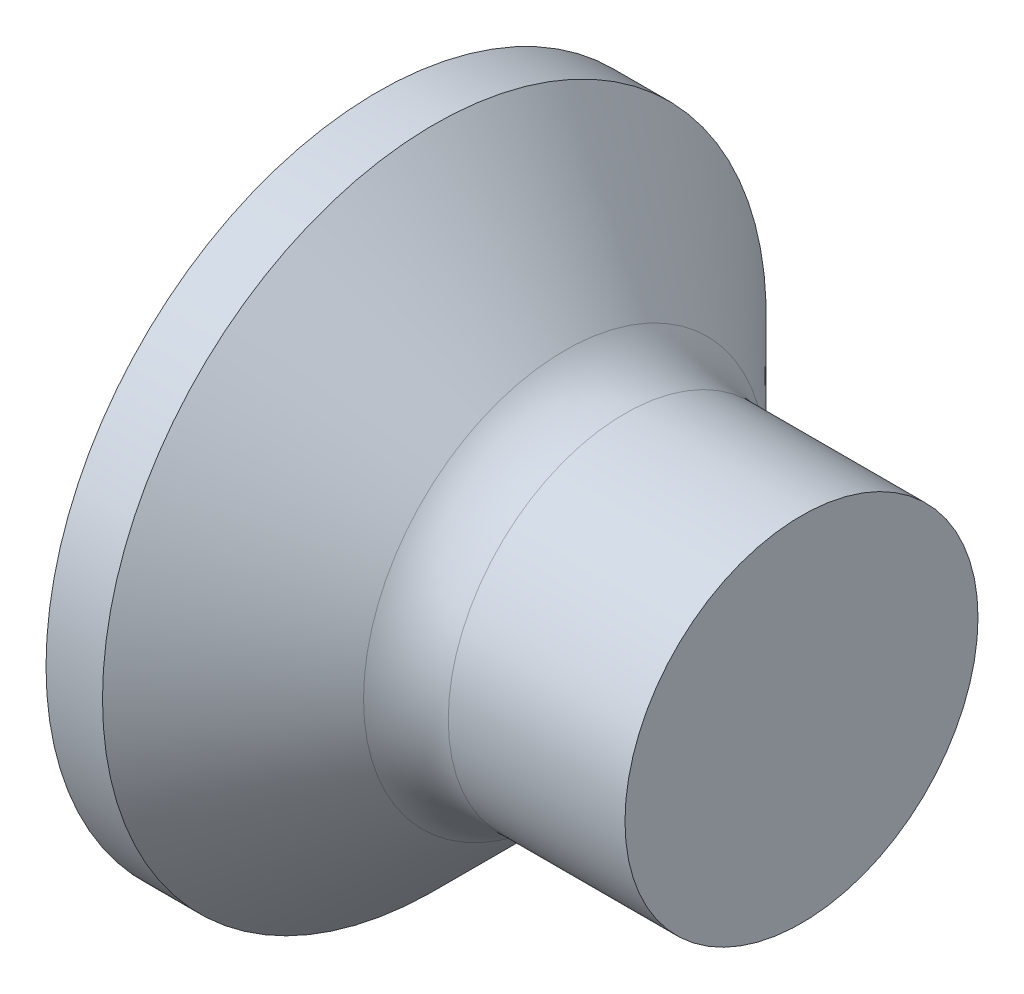
ISO-10303-21;
HEADER;
FILE_DESCRIPTION(('STEP AP214'),'2;1');
FILE_NAME('part.step','',(''),(''),'','','');
FILE_SCHEMA(('AUTOMOTIVE_DESIGN { 1 0 10303 214 1 1 1 1 }'));
ENDSEC;
DATA;
#1=APPLICATION_CONTEXT('core data for automotive mechanical design processes');
#2=APPLICATION_PROTOCOL_DEFINITION('international standard','automotive_design',2000,#1);
#3=PRODUCT_CONTEXT('',#1,'mechanical');
#4=PRODUCT('Part','Part','',(#3));
#5=PRODUCT_RELATED_PRODUCT_CATEGORY('part','',(#4));
#6=PRODUCT_DEFINITION_FORMATION('','',#4);
#7=PRODUCT_DEFINITION_CONTEXT('part definition',#1,'design');
#8=PRODUCT_DEFINITION('design','',#6,#7);
#9=PRODUCT_DEFINITION_SHAPE('','',#8);
#10=(LENGTH_UNIT() NAMED_UNIT(*) SI_UNIT(.MILLI.,.METRE.));
#11=(NAMED_UNIT(*) PLANE_ANGLE_UNIT() SI_UNIT($,.RADIAN.));
#12=(NAMED_UNIT(*) SI_UNIT($,.STERADIAN.) SOLID_ANGLE_UNIT());
#13=UNCERTAINTY_MEASURE_WITH_UNIT(LENGTH_MEASURE(1.E-05),#10,'distance_accuracy_value','');
#14=(GEOMETRIC_REPRESENTATION_CONTEXT(3) GLOBAL_UNCERTAINTY_ASSIGNED_CONTEXT((#13)) GLOBAL_UNIT_ASSIGNED_CONTEXT((#10,
#11,#12)) REPRESENTATION_CONTEXT('',''));
#15=CARTESIAN_POINT('',(0.,0.,0.));
#16=DIRECTION('',(0.,0.,1.));
#17=DIRECTION('',(1.,0.,0.));
#18=AXIS2_PLACEMENT_3D('',#15,#16,#17);
#19=CARTESIAN_POINT('',(1.73,0.370000000000002,-0.537453962312428));
#20=DIRECTION('',(-0.446197753347436,0.,0.894934391398443));
#21=DIRECTION('',(0.894934391398442,0.,0.446197753347436));
#22=AXIS2_PLACEMENT_3D('',#19,#20,#21);
#23=PLANE('',#22);
#24=DIRECTION('',(0.,1.,0.));
#25=VECTOR('',#24,1.);
#26=CARTESIAN_POINT('',(0.,0.370000000000002,-1.4));
#27=LINE('',#26,#25);
#28=CARTESIAN_POINT('',(0.,0.370000000000005,-1.4));
#29=VERTEX_POINT('',#28);
#30=CARTESIAN_POINT('',(0.,-0.369999999999995,-1.4));
#31=VERTEX_POINT('',#30);
#32=EDGE_CURVE('E173',#29,#31,#27,.F.);
#33=ORIENTED_EDGE('',*,*,#32,.T.);
#34=DIRECTION('',(-0.894934391398442,0.,-0.446197753347436));
#35=VECTOR('',#34,1.);
#36=CARTESIAN_POINT('',(1.73,-0.369999999999998,-0.53745396231243));
#37=LINE('',#36,#35);
#38=CARTESIAN_POINT('',(1.73,-0.369999999999997,-0.53745396231243));
#39=VERTEX_POINT('',#38);
#40=EDGE_CURVE('E201',#39,#31,#37,.T.);
#41=ORIENTED_EDGE('',*,*,#40,.F.);
#42=DIRECTION('',(0.,1.,0.));
#43=VECTOR('',#42,1.);
#44=CARTESIAN_POINT('',(1.73,0.370000000000002,-0.537453962312428));
#45=LINE('',#44,#43);
#46=CARTESIAN_POINT('',(1.72999999999989,-0.142405190905221,-0.53745396231243));
#47=VERTEX_POINT('',#46);
#48=EDGE_CURVE('E184',#39,#47,#45,.T.);
#49=ORIENTED_EDGE('',*,*,#48,.T.);
#50=CARTESIAN_POINT('',(2.67005399171405,0.,-0.0687604098469161));
#51=DIRECTION('',(-0.446197753347436,0.,0.894934391398443));
#52=DIRECTION('',(-0.894934391398443,0.,-0.446197753347436));
#53=AXIS2_PLACEMENT_3D('',#50,#51,#52);
#54=ELLIPSE('',#53,1.09876174310879,0.485419197280464);
#55=CARTESIAN_POINT('',(1.72999999999989,0.142405190905225,-0.537453962312429));
#56=VERTEX_POINT('',#55);
#57=EDGE_CURVE('E19',#47,#56,#54,.F.);
#58=ORIENTED_EDGE('',*,*,#57,.T.);
#59=DIRECTION('',(0.,1.,0.));
#60=VECTOR('',#59,1.);
#61=CARTESIAN_POINT('',(1.73,0.370000000000002,-0.537453962312428));
#62=LINE('',#61,#60);
#63=CARTESIAN_POINT('',(1.73,0.370000000000002,-0.537453962312428));
#64=VERTEX_POINT('',#63);
#65=EDGE_CURVE('E165',#56,#64,#62,.T.);
#66=ORIENTED_EDGE('',*,*,#65,.T.);
#67=DIRECTION('',(0.894934391398442,0.,0.446197753347436));
#68=VECTOR('',#67,1.);
#69=CARTESIAN_POINT('',(0.,0.370000000000005,-1.4));
#70=LINE('',#69,#68);
#71=EDGE_CURVE('E191',#29,#64,#70,.T.);
#72=ORIENTED_EDGE('',*,*,#71,.F.);
#73=EDGE_LOOP('',(#33,#41,#49,#58,#66,#72));
#74=FACE_BOUND('',#73,.T.);
#75=ADVANCED_FACE('F16',(#74),#23,.T.);
#76=CARTESIAN_POINT('',(1.73,-0.369999999999998,-0.53745396231243));
#77=DIRECTION('',(0.,1.,0.));
#78=DIRECTION('',(0.,0.,1.));
#79=AXIS2_PLACEMENT_3D('',#76,#77,#78);
#80=PLANE('',#79);
#81=DIRECTION('',(0.,0.,1.));
#82=VECTOR('',#81,1.);
#83=CARTESIAN_POINT('',(1.73,-0.369999999999998,-0.53745396231243));
#84=LINE('',#83,#82);
#85=CARTESIAN_POINT('',(1.73000000000445,-0.369999999999999,-0.415013252802522));
#86=VERTEX_POINT('',#85);
#87=EDGE_CURVE('E204',#86,#39,#84,.F.);
#88=ORIENTED_EDGE('',*,*,#87,.T.);
#89=ORIENTED_EDGE('',*,*,#40,.T.);
#90=DIRECTION('',(0.,0.,1.));
#91=VECTOR('',#90,1.);
#92=CARTESIAN_POINT('',(0.,-0.369999999999998,-0.53745396231243));
#93=LINE('',#92,#91);
#94=CARTESIAN_POINT('',(0.,-0.369999999999998,-0.566915305449494));
#95=VERTEX_POINT('',#94);
#96=EDGE_CURVE('E198',#31,#95,#93,.T.);
#97=ORIENTED_EDGE('',*,*,#96,.T.);
#98=CARTESIAN_POINT('',(6.21745073211009E-13,-0.369999999999998,-0.566915305449442));
#99=CARTESIAN_POINT('',(0.210211798222308,-0.369999999999998,-0.549344413477696));
#100=CARTESIAN_POINT('',(0.420407070778332,-0.369999999999998,-0.531564435264664));
#101=CARTESIAN_POINT('',(0.840738581503893,-0.369999999999998,-0.495346236705765));
#102=CARTESIAN_POINT('',(1.05087482026154,-0.369999999999998,-0.476908023170024));
#103=CARTESIAN_POINT('',(1.33915479955477,-0.369999999999998,-0.450991756825284));
#104=CARTESIAN_POINT('',(1.41733328845285,-0.369999999999999,-0.44390081102889));
#105=CARTESIAN_POINT('',(1.57367713350499,-0.369999999999999,-0.429572412876353));
#106=CARTESIAN_POINT('',(1.65184248960776,-0.369999999999999,-0.422334959960806));
#107=CARTESIAN_POINT('',(1.73000000000338,-0.369999999999999,-0.415013252805215));
#108=B_SPLINE_CURVE_WITH_KNOTS('',3,(#98,#99,#100,#101,#102,#103,#104,#105,#106,#107),
.UNSPECIFIED.,.F.,.F.,(4,2,2,2,4),(0.,0.632836027840334,1.26566551023325,1.50116361514125,
1.73666261941042),.UNSPECIFIED.);
#109=EDGE_CURVE('E503',#95,#86,#108,.T.);
#110=ORIENTED_EDGE('',*,*,#109,.T.);
#111=EDGE_LOOP('',(#88,#89,#97,#110));
#112=FACE_BOUND('',#111,.T.);
#113=ADVANCED_FACE('F521',(#112),#80,.T.);
#114=CARTESIAN_POINT('',(1.73,0.369999999999998,0.537453962312431));
#115=DIRECTION('',(0.,-1.,0.));
#116=DIRECTION('',(0.,0.,-1.));
#117=AXIS2_PLACEMENT_3D('',#114,#115,#116);
#118=PLANE('',#117);
#119=DIRECTION('',(0.,0.,-1.));
#120=VECTOR('',#119,1.);
#121=CARTESIAN_POINT('',(0.,0.369999999999998,0.537453962312431));
#122=LINE('',#121,#120);
#123=CARTESIAN_POINT('',(3.10876524219419E-13,0.370000000000002,-0.566915305449466));
#124=VERTEX_POINT('',#123);
#125=EDGE_CURVE('E194',#124,#29,#122,.T.);
#126=ORIENTED_EDGE('',*,*,#125,.T.);
#127=ORIENTED_EDGE('',*,*,#71,.T.);
#128=DIRECTION('',(0.,0.,-1.));
#129=VECTOR('',#128,1.);
#130=CARTESIAN_POINT('',(1.73,0.369999999999998,0.537453962312431));
#131=LINE('',#130,#129);
#132=CARTESIAN_POINT('',(1.73000000000445,0.370000000000001,-0.41501325280252));
#133=VERTEX_POINT('',#132);
#134=EDGE_CURVE('E169',#64,#133,#131,.F.);
#135=ORIENTED_EDGE('',*,*,#134,.T.);
#136=CARTESIAN_POINT('',(1.73000000000337,0.370000000000001,-0.41501325280514));
#137=CARTESIAN_POINT('',(1.55750312966298,0.370000000000001,-0.431158403070769));
#138=CARTESIAN_POINT('',(1.38497096483327,0.370000000000001,-0.446919624114494));
#139=CARTESIAN_POINT('',(1.03985338161292,0.370000000000002,-0.477835186705184));
#140=CARTESIAN_POINT('',(0.867267963599735,0.370000000000002,-0.492989532458464));
#141=CARTESIAN_POINT('',(0.578901935102223,0.370000000000002,-0.517935214761397));
#142=CARTESIAN_POINT('',(0.463131863674089,0.370000000000002,-0.52784915729877));
#143=CARTESIAN_POINT('',(0.231576539327035,0.370000000000002,-0.547504590063613));
#144=CARTESIAN_POINT('',(0.115791286340782,0.370000000000002,-0.557246079498232));
#145=CARTESIAN_POINT('',(6.23999141029417E-13,0.370000000000002,-0.566915305449465));
#146=B_SPLINE_CURVE_WITH_KNOTS('',3,(#136,#137,#138,#139,#140,#141,#142,#143,#144,#145),
.UNSPECIFIED.,.F.,.F.,(4,2,2,2,4),(0.,0.519751041956637,1.03949848084185,1.3880797430646,
1.73666260746864),.UNSPECIFIED.);
#147=EDGE_CURVE('E500',#133,#124,#146,.T.);
#148=ORIENTED_EDGE('',*,*,#147,.T.);
#149=EDGE_LOOP('',(#126,#127,#135,#148));
#150=FACE_BOUND('',#149,.T.);
#151=ADVANCED_FACE('F544',(#150),#118,.T.);
#152=CARTESIAN_POINT('',(0.,0.,0.));
#153=DIRECTION('',(-1.,0.,0.));
#154=DIRECTION('',(0.,0.,1.));
#155=AXIS2_PLACEMENT_3D('',#152,#153,#154);
#156=CONICAL_SURFACE('',#155,0.676973384670987,0.0698131700826303);
#157=ORIENTED_EDGE('',*,*,#109,.F.);
#158=CARTESIAN_POINT('',(0.,0.,0.));
#159=DIRECTION('',(-1.,0.,0.));
#160=DIRECTION('',(0.,0.,1.));
#161=AXIS2_PLACEMENT_3D('',#158,#159,#160);
#162=CIRCLE('',#161,0.676973384670987);
#163=CARTESIAN_POINT('',(0.,-0.566915305449493,-0.37));
#164=VERTEX_POINT('',#163);
#165=EDGE_CURVE('E193',#164,#95,#162,.F.);
#166=ORIENTED_EDGE('',*,*,#165,.F.);
#167=CARTESIAN_POINT('',(1.7300000000019,-0.415013252805279,-0.37));
#168=CARTESIAN_POINT('',(1.55750312966148,-0.431158403070909,-0.37));
#169=CARTESIAN_POINT('',(1.38497096483174,-0.446919624114635,-0.37));
#170=CARTESIAN_POINT('',(1.03985338161132,-0.477835186705327,-0.37));
#171=CARTESIAN_POINT('',(0.867267963598105,-0.492989532458607,-0.37));
#172=CARTESIAN_POINT('',(0.578901935100858,-0.517935214761515,-0.37));
#173=CARTESIAN_POINT('',(0.463131863673021,-0.527849157298863,-0.37));
#174=CARTESIAN_POINT('',(0.231576539326561,-0.547504590063654,-0.37));
#175=CARTESIAN_POINT('',(0.115791286340606,-0.557246079498248,-0.37));
#176=CARTESIAN_POINT('',(7.45224788667917E-13,-0.566915305449457,-0.37));
#177=B_SPLINE_CURVE_WITH_KNOTS('',3,(#167,#168,#169,#170,#171,#172,#173,#174,#175,#176),
.UNSPECIFIED.,.F.,.F.,(4,2,2,2,4),(0.,0.519751041956733,1.03949848084204,1.38807974306389,
1.73666260746704),.UNSPECIFIED.);
#178=CARTESIAN_POINT('',(1.73000000000445,-0.415013252802521,-0.37));
#179=VERTEX_POINT('',#178);
#180=EDGE_CURVE('E490',#179,#164,#177,.T.);
#181=ORIENTED_EDGE('',*,*,#180,.F.);
#182=CARTESIAN_POINT('',(1.73000000000911,0.,0.));
#183=DIRECTION('',(-1.,0.,0.));
#184=DIRECTION('',(0.,0.,1.));
#185=AXIS2_PLACEMENT_3D('',#182,#183,#184);
#186=CIRCLE('',#185,0.55600000000311);
#187=EDGE_CURVE('E501',#86,#179,#186,.T.);
#188=ORIENTED_EDGE('',*,*,#187,.F.);
#189=EDGE_LOOP('',(#157,#166,#181,#188));
#190=FACE_BOUND('',#189,.T.);
#191=ADVANCED_FACE('F524',(#190),#156,.F.);
#192=CARTESIAN_POINT('',(0.,0.,0.));
#193=DIRECTION('',(-1.,0.,0.));
#194=DIRECTION('',(0.,0.,1.));
#195=AXIS2_PLACEMENT_3D('',#192,#193,#194);
#196=CONICAL_SURFACE('',#195,0.676973384670987,0.0698131700826303);
#197=ORIENTED_EDGE('',*,*,#147,.F.);
#198=CARTESIAN_POINT('',(1.73000000000911,0.,0.));
#199=DIRECTION('',(-1.,0.,0.));
#200=DIRECTION('',(0.,0.,1.));
#201=AXIS2_PLACEMENT_3D('',#198,#199,#200);
#202=CIRCLE('',#201,0.55600000000311);
#203=CARTESIAN_POINT('',(1.73000000000445,0.415013252802521,-0.37));
#204=VERTEX_POINT('',#203);
#205=EDGE_CURVE('E177',#204,#133,#202,.T.);
#206=ORIENTED_EDGE('',*,*,#205,.F.);
#207=CARTESIAN_POINT('',(7.42964703682483E-13,0.566915305449431,-0.37));
#208=CARTESIAN_POINT('',(0.210211798222427,0.549344413477684,-0.37));
#209=CARTESIAN_POINT('',(0.420407070778448,0.531564435264652,-0.37));
#210=CARTESIAN_POINT('',(0.840738581504004,0.495346236705754,-0.37));
#211=CARTESIAN_POINT('',(1.05087482026165,0.476908023170013,-0.37));
#212=CARTESIAN_POINT('',(1.33915479955461,0.450991756825297,-0.37));
#213=CARTESIAN_POINT('',(1.41733328845243,0.443900811028927,-0.37));
#214=CARTESIAN_POINT('',(1.57367713350405,0.429572412876438,-0.37));
#215=CARTESIAN_POINT('',(1.65184248960656,0.422334959960917,-0.37));
#216=CARTESIAN_POINT('',(1.73000000000191,0.415013252805352,-0.37));
#217=B_SPLINE_CURVE_WITH_KNOTS('',3,(#207,#208,#209,#210,#211,#212,#213,#214,#215,#216),
.UNSPECIFIED.,.F.,.F.,(4,2,2,2,4),(0.,0.632836027840326,1.26566551023323,1.50116361514044,
1.73666261940883),.UNSPECIFIED.);
#218=CARTESIAN_POINT('',(3.71481800429003E-13,0.566915305449462,-0.37));
#219=VERTEX_POINT('',#218);
#220=EDGE_CURVE('E480',#219,#204,#217,.T.);
#221=ORIENTED_EDGE('',*,*,#220,.F.);
#222=CARTESIAN_POINT('',(0.,0.,0.));
#223=DIRECTION('',(-1.,0.,0.));
#224=DIRECTION('',(0.,0.,1.));
#225=AXIS2_PLACEMENT_3D('',#222,#223,#224);
#226=CIRCLE('',#225,0.676973384670987);
#227=EDGE_CURVE('E496',#124,#219,#226,.F.);
#228=ORIENTED_EDGE('',*,*,#227,.F.);
#229=EDGE_LOOP('',(#197,#206,#221,#228));
#230=FACE_BOUND('',#229,.T.);
#231=ADVANCED_FACE('F551',(#230),#196,.F.);
#232=CARTESIAN_POINT('',(1.73,0.53745396231243,-0.37));
#233=DIRECTION('',(0.,0.,1.));
#234=DIRECTION('',(1.,0.,0.));
#235=AXIS2_PLACEMENT_3D('',#232,#233,#234);
#236=PLANE('',#235);
#237=DIRECTION('',(0.,1.,0.));
#238=VECTOR('',#237,1.);
#239=CARTESIAN_POINT('',(0.,0.53745396231243,-0.37));
#240=LINE('',#239,#238);
#241=CARTESIAN_POINT('',(0.,-1.4,-0.37));
#242=VERTEX_POINT('',#241);
#243=EDGE_CURVE('E486',#164,#242,#240,.F.);
#244=ORIENTED_EDGE('',*,*,#243,.T.);
#245=DIRECTION('',(-0.894934391398442,-0.446197753347436,0.));
#246=VECTOR('',#245,1.);
#247=CARTESIAN_POINT('',(1.73,-0.537453962312429,-0.37));
#248=LINE('',#247,#246);
#249=CARTESIAN_POINT('',(1.73,-0.537453962312429,-0.37));
#250=VERTEX_POINT('',#249);
#251=EDGE_CURVE('E467',#250,#242,#248,.T.);
#252=ORIENTED_EDGE('',*,*,#251,.F.);
#253=DIRECTION('',(0.,1.,0.));
#254=VECTOR('',#253,1.);
#255=CARTESIAN_POINT('',(1.73,0.53745396231243,-0.37));
#256=LINE('',#255,#254);
#257=EDGE_CURVE('E493',#250,#179,#256,.T.);
#258=ORIENTED_EDGE('',*,*,#257,.T.);
#259=ORIENTED_EDGE('',*,*,#180,.T.);
#260=EDGE_LOOP('',(#244,#252,#258,#259));
#261=FACE_BOUND('',#260,.T.);
#262=ADVANCED_FACE('F590',(#261),#236,.T.);
#263=CARTESIAN_POINT('',(1.73,0.53745396231243,-0.37));
#264=DIRECTION('',(0.,0.,1.));
#265=DIRECTION('',(1.,0.,0.));
#266=AXIS2_PLACEMENT_3D('',#263,#264,#265);
#267=PLANE('',#266);
#268=DIRECTION('',(0.,1.,0.));
#269=VECTOR('',#268,1.);
#270=CARTESIAN_POINT('',(1.73,0.53745396231243,-0.37));
#271=LINE('',#270,#269);
#272=CARTESIAN_POINT('',(1.73,0.53745396231243,-0.37));
#273=VERTEX_POINT('',#272);
#274=EDGE_CURVE('E472',#204,#273,#271,.T.);
#275=ORIENTED_EDGE('',*,*,#274,.T.);
#276=DIRECTION('',(0.894934391398443,-0.446197753347436,0.));
#277=VECTOR('',#276,1.);
#278=CARTESIAN_POINT('',(1.73,0.537453962312429,-0.37));
#279=LINE('',#278,#277);
#280=CARTESIAN_POINT('',(0.,1.4,-0.37));
#281=VERTEX_POINT('',#280);
#282=EDGE_CURVE('E459',#281,#273,#279,.T.);
#283=ORIENTED_EDGE('',*,*,#282,.F.);
#284=DIRECTION('',(0.,1.,0.));
#285=VECTOR('',#284,1.);
#286=CARTESIAN_POINT('',(0.,0.53745396231243,-0.37));
#287=LINE('',#286,#285);
#288=EDGE_CURVE('E483',#281,#219,#287,.F.);
#289=ORIENTED_EDGE('',*,*,#288,.T.);
#290=ORIENTED_EDGE('',*,*,#220,.T.);
#291=EDGE_LOOP('',(#275,#283,#289,#290));
#292=FACE_BOUND('',#291,.T.);
#293=ADVANCED_FACE('F585',(#292),#267,.T.);
#294=CARTESIAN_POINT('',(3.,1.25,0.));
#295=DIRECTION('',(1.,0.,0.));
#296=DIRECTION('',(0.,0.,-1.));
#297=AXIS2_PLACEMENT_3D('',#294,#295,#296);
#298=PLANE('',#297);
#299=CARTESIAN_POINT('',(3.,0.,0.));
#300=DIRECTION('',(-1.,0.,0.));
#301=DIRECTION('',(0.,0.,1.));
#302=AXIS2_PLACEMENT_3D('',#299,#300,#301);
#303=CIRCLE('',#302,1.25);
#304=CARTESIAN_POINT('',(3.,0.,1.25));
#305=VERTEX_POINT('',#304);
#306=EDGE_CURVE('E448',#305,#305,#303,.T.);
#307=ORIENTED_EDGE('',*,*,#306,.F.);
#308=EDGE_LOOP('',(#307));
#309=FACE_BOUND('',#308,.T.);
#310=ADVANCED_FACE('F589',(#309),#298,.T.);
#311=CARTESIAN_POINT('',(1.73,-0.537453962312429,-0.37));
#312=DIRECTION('',(-0.446197753347436,0.894934391398443,0.));
#313=DIRECTION('',(-0.894934391398442,-0.446197753347436,0.));
#314=AXIS2_PLACEMENT_3D('',#311,#312,#313);
#315=PLANE('',#314);
#316=DIRECTION('',(0.,0.,1.));
#317=VECTOR('',#316,1.);
#318=CARTESIAN_POINT('',(0.,-1.4,-0.37));
#319=LINE('',#318,#317);
#320=CARTESIAN_POINT('',(0.,-1.4,0.37));
#321=VERTEX_POINT('',#320);
#322=EDGE_CURVE('E460',#242,#321,#319,.T.);
#323=ORIENTED_EDGE('',*,*,#322,.T.);
#324=DIRECTION('',(-0.894934391398442,-0.446197753347436,0.));
#325=VECTOR('',#324,1.);
#326=CARTESIAN_POINT('',(1.73,-0.537453962312429,0.37));
#327=LINE('',#326,#325);
#328=CARTESIAN_POINT('',(1.73,-0.537453962312429,0.37));
#329=VERTEX_POINT('',#328);
#330=EDGE_CURVE('E403',#329,#321,#327,.T.);
#331=ORIENTED_EDGE('',*,*,#330,.F.);
#332=DIRECTION('',(0.,0.,-1.));
#333=VECTOR('',#332,1.);
#334=CARTESIAN_POINT('',(1.73,-0.537453962312429,-0.37));
#335=LINE('',#334,#333);
#336=CARTESIAN_POINT('',(1.72999999999989,-0.53745396231243,0.142405190905223));
#337=VERTEX_POINT('',#336);
#338=EDGE_CURVE('E433',#329,#337,#335,.T.);
#339=ORIENTED_EDGE('',*,*,#338,.T.);
#340=CARTESIAN_POINT('',(2.67005399171405,-0.0687604098469161,0.));
#341=DIRECTION('',(-0.446197753347436,0.894934391398443,0.));
#342=DIRECTION('',(-0.894934391398443,-0.446197753347436,0.));
#343=AXIS2_PLACEMENT_3D('',#340,#341,#342);
#344=ELLIPSE('',#343,1.09876174310879,0.485419197280464);
#345=CARTESIAN_POINT('',(1.72999999999989,-0.53745396231243,-0.142405190905223));
#346=VERTEX_POINT('',#345);
#347=EDGE_CURVE('E425',#337,#346,#344,.F.);
#348=ORIENTED_EDGE('',*,*,#347,.T.);
#349=DIRECTION('',(0.,0.,-1.));
#350=VECTOR('',#349,1.);
#351=CARTESIAN_POINT('',(1.73,-0.537453962312429,-0.37));
#352=LINE('',#351,#350);
#353=EDGE_CURVE('E418',#346,#250,#352,.T.);
#354=ORIENTED_EDGE('',*,*,#353,.T.);
#355=ORIENTED_EDGE('',*,*,#251,.T.);
#356=EDGE_LOOP('',(#323,#331,#339,#348,#354,#355));
#357=FACE_BOUND('',#356,.T.);
#358=ADVANCED_FACE('F605',(#357),#315,.T.);
#359=CARTESIAN_POINT('',(1.73,0.537453962312429,0.37));
#360=DIRECTION('',(-0.446197753347436,-0.894934391398443,0.));
#361=DIRECTION('',(0.894934391398443,-0.446197753347436,0.));
#362=AXIS2_PLACEMENT_3D('',#359,#360,#361);
#363=PLANE('',#362);
#364=DIRECTION('',(0.,0.,1.));
#365=VECTOR('',#364,1.);
#366=CARTESIAN_POINT('',(0.,1.4,0.37));
#367=LINE('',#366,#365);
#368=CARTESIAN_POINT('',(0.,1.4,0.37));
#369=VERTEX_POINT('',#368);
#370=EDGE_CURVE('E456',#369,#281,#367,.F.);
#371=ORIENTED_EDGE('',*,*,#370,.T.);
#372=ORIENTED_EDGE('',*,*,#282,.T.);
#373=DIRECTION('',(0.,0.,-1.));
#374=VECTOR('',#373,1.);
#375=CARTESIAN_POINT('',(1.73,0.537453962312429,-0.37));
#376=LINE('',#375,#374);
#377=CARTESIAN_POINT('',(1.72999999999989,0.53745396231243,-0.142405190905222));
#378=VERTEX_POINT('',#377);
#379=EDGE_CURVE('E446',#273,#378,#376,.F.);
#380=ORIENTED_EDGE('',*,*,#379,.T.);
#381=CARTESIAN_POINT('',(2.67005399171405,0.0687604098469166,0.));
#382=DIRECTION('',(-0.446197753347436,-0.894934391398443,0.));
#383=DIRECTION('',(-0.894934391398443,0.446197753347436,0.));
#384=AXIS2_PLACEMENT_3D('',#381,#382,#383);
#385=ELLIPSE('',#384,1.09876174310879,0.485419197280464);
#386=CARTESIAN_POINT('',(1.72999999999989,0.53745396231243,0.142405190905222));
#387=VERTEX_POINT('',#386);
#388=EDGE_CURVE('E439',#378,#387,#385,.F.);
#389=ORIENTED_EDGE('',*,*,#388,.T.);
#390=DIRECTION('',(0.,0.,-1.));
#391=VECTOR('',#390,1.);
#392=CARTESIAN_POINT('',(1.73,0.53745396231243,-0.37));
#393=LINE('',#392,#391);
#394=CARTESIAN_POINT('',(1.73,0.53745396231243,0.37));
#395=VERTEX_POINT('',#394);
#396=EDGE_CURVE('E435',#387,#395,#393,.F.);
#397=ORIENTED_EDGE('',*,*,#396,.T.);
#398=DIRECTION('',(0.894934391398442,-0.446197753347436,0.));
#399=VECTOR('',#398,1.);
#400=CARTESIAN_POINT('',(0.,1.4,0.37));
#401=LINE('',#400,#399);
#402=EDGE_CURVE('E400',#369,#395,#401,.T.);
#403=ORIENTED_EDGE('',*,*,#402,.F.);
#404=EDGE_LOOP('',(#371,#372,#380,#389,#397,#403));
#405=FACE_BOUND('',#404,.T.);
#406=ADVANCED_FACE('F640',(#405),#363,.T.);
#407=CARTESIAN_POINT('',(-6.34999999999999,0.,0.));
#408=DIRECTION('',(-1.,0.,0.));
#409=DIRECTION('',(0.,0.,1.));
#410=AXIS2_PLACEMENT_3D('',#407,#408,#409);
#411=CYLINDRICAL_SURFACE('',#410,1.25);
#412=ORIENTED_EDGE('',*,*,#306,.T.);
#413=EDGE_LOOP('',(#412));
#414=FACE_BOUND('',#413,.T.);
#415=CARTESIAN_POINT('',(1.74852813742386,0.,0.));
#416=DIRECTION('',(-1.,0.,0.));
#417=DIRECTION('',(0.,0.,1.));
#418=AXIS2_PLACEMENT_3D('',#415,#416,#417);
#419=CIRCLE('',#418,1.25);
#420=CARTESIAN_POINT('',(1.74852813742386,0.,1.25));
#421=VERTEX_POINT('',#420);
#422=EDGE_CURVE('E179',#421,#421,#419,.F.);
#423=ORIENTED_EDGE('',*,*,#422,.T.);
#424=EDGE_LOOP('',(#423));
#425=FACE_BOUND('',#424,.T.);
#426=ADVANCED_FACE('F637',(#414,#425),#411,.T.);
#427=CARTESIAN_POINT('',(1.73,0.537453962312429,-0.37));
#428=DIRECTION('',(1.,0.,0.));
#429=DIRECTION('',(0.,0.,-1.));
#430=AXIS2_PLACEMENT_3D('',#427,#428,#429);
#431=PLANE('',#430);
#432=ORIENTED_EDGE('',*,*,#134,.F.);
#433=ORIENTED_EDGE('',*,*,#65,.F.);
#434=CARTESIAN_POINT('',(1.72999999999979,0.,0.));
#435=DIRECTION('',(-1.,0.,0.));
#436=DIRECTION('',(0.,0.,1.));
#437=AXIS2_PLACEMENT_3D('',#434,#435,#436);
#438=CIRCLE('',#437,0.556000000000001);
#439=EDGE_CURVE('E167',#56,#133,#438,.F.);
#440=ORIENTED_EDGE('',*,*,#439,.T.);
#441=EDGE_LOOP('',(#432,#433,#440));
#442=FACE_BOUND('',#441,.T.);
#443=ADVANCED_FACE('F166',(#442),#431,.F.);
#444=CARTESIAN_POINT('',(1.73,0.537453962312429,-0.37));
#445=DIRECTION('',(1.,0.,0.));
#446=DIRECTION('',(0.,0.,-1.));
#447=AXIS2_PLACEMENT_3D('',#444,#445,#446);
#448=PLANE('',#447);
#449=ORIENTED_EDGE('',*,*,#379,.F.);
#450=ORIENTED_EDGE('',*,*,#274,.F.);
#451=CARTESIAN_POINT('',(1.72999999999979,0.,0.));
#452=DIRECTION('',(-1.,0.,0.));
#453=DIRECTION('',(0.,0.,1.));
#454=AXIS2_PLACEMENT_3D('',#451,#452,#453);
#455=CIRCLE('',#454,0.556000000000001);
#456=EDGE_CURVE('E178',#204,#378,#455,.F.);
#457=ORIENTED_EDGE('',*,*,#456,.T.);
#458=EDGE_LOOP('',(#449,#450,#457));
#459=FACE_BOUND('',#458,.T.);
#460=ADVANCED_FACE('F630',(#459),#448,.F.);
#461=CARTESIAN_POINT('',(1.68695256780893,0.,0.));
#462=DIRECTION('',(-1.,0.,0.));
#463=DIRECTION('',(0.,0.,1.));
#464=AXIS2_PLACEMENT_3D('',#461,#462,#463);
#465=CONICAL_SURFACE('',#464,0.55901016970239,0.0698131701529839);
#466=ORIENTED_EDGE('',*,*,#388,.F.);
#467=CARTESIAN_POINT('',(1.72999999999979,0.,0.));
#468=DIRECTION('',(-1.,0.,0.));
#469=DIRECTION('',(0.,0.,1.));
#470=AXIS2_PLACEMENT_3D('',#467,#468,#469);
#471=CIRCLE('',#470,0.556000000000001);
#472=EDGE_CURVE('E442',#378,#387,#471,.F.);
#473=ORIENTED_EDGE('',*,*,#472,.T.);
#474=EDGE_LOOP('',(#466,#473));
#475=FACE_BOUND('',#474,.T.);
#476=ADVANCED_FACE('F627',(#475),#465,.F.);
#477=CARTESIAN_POINT('',(1.73,0.537453962312429,-0.37));
#478=DIRECTION('',(1.,0.,0.));
#479=DIRECTION('',(0.,0.,-1.));
#480=AXIS2_PLACEMENT_3D('',#477,#478,#479);
#481=PLANE('',#480);
#482=DIRECTION('',(0.,1.,0.));
#483=VECTOR('',#482,1.);
#484=CARTESIAN_POINT('',(1.73,-0.537453962312429,0.37));
#485=LINE('',#484,#483);
#486=CARTESIAN_POINT('',(1.73000000000445,0.415013252802521,0.370000000000001));
#487=VERTEX_POINT('',#486);
#488=EDGE_CURVE('E398',#395,#487,#485,.F.);
#489=ORIENTED_EDGE('',*,*,#488,.F.);
#490=ORIENTED_EDGE('',*,*,#396,.F.);
#491=CARTESIAN_POINT('',(1.72999999999979,0.,0.));
#492=DIRECTION('',(-1.,0.,0.));
#493=DIRECTION('',(0.,0.,1.));
#494=AXIS2_PLACEMENT_3D('',#491,#492,#493);
#495=CIRCLE('',#494,0.556000000000001);
#496=EDGE_CURVE('E445',#387,#487,#495,.F.);
#497=ORIENTED_EDGE('',*,*,#496,.T.);
#498=EDGE_LOOP('',(#489,#490,#497));
#499=FACE_BOUND('',#498,.T.);
#500=ADVANCED_FACE('F620',(#499),#481,.F.);
#501=CARTESIAN_POINT('',(1.73,0.537453962312429,-0.37));
#502=DIRECTION('',(1.,0.,0.));
#503=DIRECTION('',(0.,0.,-1.));
#504=AXIS2_PLACEMENT_3D('',#501,#502,#503);
#505=PLANE('',#504);
#506=ORIENTED_EDGE('',*,*,#338,.F.);
#507=DIRECTION('',(0.,1.,0.));
#508=VECTOR('',#507,1.);
#509=CARTESIAN_POINT('',(1.73,-0.537453962312429,0.37));
#510=LINE('',#509,#508);
#511=CARTESIAN_POINT('',(1.73000000000445,-0.415013252802521,0.370000000000001));
#512=VERTEX_POINT('',#511);
#513=EDGE_CURVE('E406',#512,#329,#510,.F.);
#514=ORIENTED_EDGE('',*,*,#513,.F.);
#515=CARTESIAN_POINT('',(1.72999999999979,0.,0.));
#516=DIRECTION('',(-1.,0.,0.));
#517=DIRECTION('',(0.,0.,1.));
#518=AXIS2_PLACEMENT_3D('',#515,#516,#517);
#519=CIRCLE('',#518,0.556000000000001);
#520=EDGE_CURVE('E432',#512,#337,#519,.F.);
#521=ORIENTED_EDGE('',*,*,#520,.T.);
#522=EDGE_LOOP('',(#506,#514,#521));
#523=FACE_BOUND('',#522,.T.);
#524=ADVANCED_FACE('F613',(#523),#505,.F.);
#525=CARTESIAN_POINT('',(1.68695256780893,0.,0.));
#526=DIRECTION('',(-1.,0.,0.));
#527=DIRECTION('',(0.,0.,1.));
#528=AXIS2_PLACEMENT_3D('',#525,#526,#527);
#529=CONICAL_SURFACE('',#528,0.55901016970239,0.0698131701529839);
#530=ORIENTED_EDGE('',*,*,#347,.F.);
#531=CARTESIAN_POINT('',(1.72999999999979,0.,0.));
#532=DIRECTION('',(-1.,0.,0.));
#533=DIRECTION('',(0.,0.,1.));
#534=AXIS2_PLACEMENT_3D('',#531,#532,#533);
#535=CIRCLE('',#534,0.556000000000001);
#536=EDGE_CURVE('E428',#337,#346,#535,.F.);
#537=ORIENTED_EDGE('',*,*,#536,.T.);
#538=EDGE_LOOP('',(#530,#537));
#539=FACE_BOUND('',#538,.T.);
#540=ADVANCED_FACE('F611',(#539),#529,.F.);
#541=CARTESIAN_POINT('',(1.73,0.537453962312429,-0.37));
#542=DIRECTION('',(1.,0.,0.));
#543=DIRECTION('',(0.,0.,-1.));
#544=AXIS2_PLACEMENT_3D('',#541,#542,#543);
#545=PLANE('',#544);
#546=ORIENTED_EDGE('',*,*,#257,.F.);
#547=ORIENTED_EDGE('',*,*,#353,.F.);
#548=CARTESIAN_POINT('',(1.72999999999979,0.,0.));
#549=DIRECTION('',(-1.,0.,0.));
#550=DIRECTION('',(0.,0.,1.));
#551=AXIS2_PLACEMENT_3D('',#548,#549,#550);
#552=CIRCLE('',#551,0.556000000000001);
#553=EDGE_CURVE('E431',#346,#179,#552,.F.);
#554=ORIENTED_EDGE('',*,*,#553,.T.);
#555=EDGE_LOOP('',(#546,#547,#554));
#556=FACE_BOUND('',#555,.T.);
#557=ADVANCED_FACE('F607',(#556),#545,.F.);
#558=CARTESIAN_POINT('',(1.73,0.537453962312429,-0.37));
#559=DIRECTION('',(1.,0.,0.));
#560=DIRECTION('',(0.,0.,-1.));
#561=AXIS2_PLACEMENT_3D('',#558,#559,#560);
#562=PLANE('',#561);
#563=ORIENTED_EDGE('',*,*,#48,.F.);
#564=ORIENTED_EDGE('',*,*,#87,.F.);
#565=CARTESIAN_POINT('',(1.72999999999979,0.,0.));
#566=DIRECTION('',(-1.,0.,0.));
#567=DIRECTION('',(0.,0.,1.));
#568=AXIS2_PLACEMENT_3D('',#565,#566,#567);
#569=CIRCLE('',#568,0.556000000000001);
#570=EDGE_CURVE('E160',#86,#47,#569,.F.);
#571=ORIENTED_EDGE('',*,*,#570,.T.);
#572=EDGE_LOOP('',(#563,#564,#571));
#573=FACE_BOUND('',#572,.T.);
#574=ADVANCED_FACE('F557',(#573),#562,.F.);
#575=CARTESIAN_POINT('',(1.68695256780893,0.,0.));
#576=DIRECTION('',(-1.,0.,0.));
#577=DIRECTION('',(0.,0.,1.));
#578=AXIS2_PLACEMENT_3D('',#575,#576,#577);
#579=CONICAL_SURFACE('',#578,0.55901016970239,0.0698131701529839);
#580=ORIENTED_EDGE('',*,*,#57,.F.);
#581=CARTESIAN_POINT('',(1.72999999999979,0.,0.));
#582=DIRECTION('',(-1.,0.,0.));
#583=DIRECTION('',(0.,0.,1.));
#584=AXIS2_PLACEMENT_3D('',#581,#582,#583);
#585=CIRCLE('',#584,0.556000000000001);
#586=EDGE_CURVE('E152',#47,#56,#585,.F.);
#587=ORIENTED_EDGE('',*,*,#586,.T.);
#588=EDGE_LOOP('',(#580,#587));
#589=FACE_BOUND('',#588,.T.);
#590=ADVANCED_FACE('F154',(#589),#579,.F.);
#591=CARTESIAN_POINT('',(1.73,-0.537453962312429,0.37));
#592=DIRECTION('',(0.,0.,-1.));
#593=DIRECTION('',(0.,1.,0.));
#594=AXIS2_PLACEMENT_3D('',#591,#592,#593);
#595=PLANE('',#594);
#596=ORIENTED_EDGE('',*,*,#513,.T.);
#597=ORIENTED_EDGE('',*,*,#330,.T.);
#598=DIRECTION('',(0.,1.,0.));
#599=VECTOR('',#598,1.);
#600=CARTESIAN_POINT('',(0.,-0.537453962312429,0.37));
#601=LINE('',#600,#599);
#602=CARTESIAN_POINT('',(0.,-0.566915305449493,0.37));
#603=VERTEX_POINT('',#602);
#604=EDGE_CURVE('E414',#321,#603,#601,.T.);
#605=ORIENTED_EDGE('',*,*,#604,.T.);
#606=CARTESIAN_POINT('',(6.21752740174333E-13,-0.566915305449441,0.37));
#607=CARTESIAN_POINT('',(0.210211798222308,-0.549344413477694,0.37));
#608=CARTESIAN_POINT('',(0.420407070778332,-0.531564435264662,0.37));
#609=CARTESIAN_POINT('',(0.840738581503893,-0.495346236705763,0.37));
#610=CARTESIAN_POINT('',(1.05087482026154,-0.476908023170023,0.37));
#611=CARTESIAN_POINT('',(1.33915479955477,-0.450991756825282,0.37));
#612=CARTESIAN_POINT('',(1.41733328845285,-0.443900811028889,0.37));
#613=CARTESIAN_POINT('',(1.57367713350499,-0.429572412876351,0.37));
#614=CARTESIAN_POINT('',(1.65184248960776,-0.422334959960805,0.37));
#615=CARTESIAN_POINT('',(1.73000000000338,-0.415013252805214,0.37));
#616=B_SPLINE_CURVE_WITH_KNOTS('',3,(#606,#607,#608,#609,#610,#611,#612,#613,#614,#615),
.UNSPECIFIED.,.F.,.F.,(4,2,2,2,4),(0.,0.632836027840334,1.26566551023325,1.50116361514125,
1.73666261941042),.UNSPECIFIED.);
#617=EDGE_CURVE('E159',#603,#512,#616,.T.);
#618=ORIENTED_EDGE('',*,*,#617,.T.);
#619=EDGE_LOOP('',(#596,#597,#605,#618));
#620=FACE_BOUND('',#619,.T.);
#621=ADVANCED_FACE('F323',(#620),#595,.T.);
#622=CARTESIAN_POINT('',(1.73,-0.537453962312429,0.37));
#623=DIRECTION('',(0.,0.,-1.));
#624=DIRECTION('',(0.,1.,0.));
#625=AXIS2_PLACEMENT_3D('',#622,#623,#624);
#626=PLANE('',#625);
#627=DIRECTION('',(0.,1.,0.));
#628=VECTOR('',#627,1.);
#629=CARTESIAN_POINT('',(0.,-0.537453962312429,0.37));
#630=LINE('',#629,#628);
#631=CARTESIAN_POINT('',(3.10876213533771E-13,0.566915305449467,0.37));
#632=VERTEX_POINT('',#631);
#633=EDGE_CURVE('E311',#632,#369,#630,.T.);
#634=ORIENTED_EDGE('',*,*,#633,.T.);
#635=ORIENTED_EDGE('',*,*,#402,.T.);
#636=ORIENTED_EDGE('',*,*,#488,.T.);
#637=CARTESIAN_POINT('',(1.73000000000337,0.415013252805142,0.37));
#638=CARTESIAN_POINT('',(1.55750312966298,0.431158403070771,0.37));
#639=CARTESIAN_POINT('',(1.38497096483327,0.446919624114496,0.37));
#640=CARTESIAN_POINT('',(1.03985338161292,0.477835186705185,0.37));
#641=CARTESIAN_POINT('',(0.867267963599735,0.492989532458465,0.37));
#642=CARTESIAN_POINT('',(0.578901935102223,0.517935214761398,0.37));
#643=CARTESIAN_POINT('',(0.463131863674089,0.527849157298771,0.37));
#644=CARTESIAN_POINT('',(0.231576539327035,0.547504590063615,0.37));
#645=CARTESIAN_POINT('',(0.115791286340782,0.557246079498233,0.37));
#646=CARTESIAN_POINT('',(6.2411602134624E-13,0.566915305449467,0.37));
#647=B_SPLINE_CURVE_WITH_KNOTS('',3,(#637,#638,#639,#640,#641,#642,#643,#644,#645,#646),
.UNSPECIFIED.,.F.,.F.,(4,2,2,2,4),(0.,0.519751041956637,1.03949848084185,1.3880797430646,
1.73666260746864),.UNSPECIFIED.);
#648=EDGE_CURVE('E328',#487,#632,#647,.T.);
#649=ORIENTED_EDGE('',*,*,#648,.T.);
#650=EDGE_LOOP('',(#634,#635,#636,#649));
#651=FACE_BOUND('',#650,.T.);
#652=ADVANCED_FACE('F318',(#651),#626,.T.);
#653=CARTESIAN_POINT('',(1.74852813742386,0.,0.));
#654=DIRECTION('',(-1.,0.,0.));
#655=DIRECTION('',(0.,0.,1.));
#656=AXIS2_PLACEMENT_3D('',#653,#654,#655);
#657=TOROIDAL_SURFACE('',#656,1.85,0.6);
#658=ORIENTED_EDGE('',*,*,#422,.F.);
#659=EDGE_LOOP('',(#658));
#660=FACE_BOUND('',#659,.T.);
#661=CARTESIAN_POINT('',(1.32426406867125,0.,0.));
#662=DIRECTION('',(-1.,0.,0.));
#663=DIRECTION('',(0.,0.,1.));
#664=AXIS2_PLACEMENT_3D('',#661,#662,#663);
#665=CIRCLE('',#664,1.42573593126372);
#666=CARTESIAN_POINT('',(1.32426406867125,0.,1.42573593126372));
#667=VERTEX_POINT('',#666);
#668=EDGE_CURVE('E299',#667,#667,#665,.T.);
#669=ORIENTED_EDGE('',*,*,#668,.F.);
#670=EDGE_LOOP('',(#669));
#671=FACE_BOUND('',#670,.T.);
#672=ADVANCED_FACE('F314',(#660,#671),#657,.F.);
#673=CARTESIAN_POINT('',(1.72999999999979,0.,0.));
#674=DIRECTION('',(-1.,0.,0.));
#675=DIRECTION('',(0.,0.,1.));
#676=AXIS2_PLACEMENT_3D('',#673,#674,#675);
#677=CONICAL_SURFACE('',#676,0.556000000000001,1.25663706143599);
#678=CARTESIAN_POINT('',(1.91065535110524,0.,0.));
#679=VERTEX_POINT('',#678);
#680=VERTEX_LOOP('',#679);
#681=FACE_BOUND('',#680,.T.);
#682=ORIENTED_EDGE('',*,*,#439,.F.);
#683=ORIENTED_EDGE('',*,*,#586,.F.);
#684=ORIENTED_EDGE('',*,*,#570,.F.);
#685=ORIENTED_EDGE('',*,*,#187,.T.);
#686=ORIENTED_EDGE('',*,*,#553,.F.);
#687=ORIENTED_EDGE('',*,*,#536,.F.);
#688=ORIENTED_EDGE('',*,*,#520,.F.);
#689=CARTESIAN_POINT('',(1.73000000000911,0.,0.));
#690=DIRECTION('',(-1.,0.,0.));
#691=DIRECTION('',(0.,0.,1.));
#692=AXIS2_PLACEMENT_3D('',#689,#690,#691);
#693=CIRCLE('',#692,0.55600000000311);
#694=CARTESIAN_POINT('',(1.73000000000445,-0.370000000000001,0.41501325280252));
#695=VERTEX_POINT('',#694);
#696=EDGE_CURVE('E304',#512,#695,#693,.T.);
#697=ORIENTED_EDGE('',*,*,#696,.T.);
#698=CARTESIAN_POINT('',(1.72999999999979,0.,0.));
#699=DIRECTION('',(-1.,0.,0.));
#700=DIRECTION('',(0.,0.,1.));
#701=AXIS2_PLACEMENT_3D('',#698,#699,#700);
#702=CIRCLE('',#701,0.556000000000001);
#703=CARTESIAN_POINT('',(1.73000000000445,-0.142405190912553,0.537453962310158));
#704=VERTEX_POINT('',#703);
#705=EDGE_CURVE('E368',#695,#704,#702,.T.);
#706=ORIENTED_EDGE('',*,*,#705,.T.);
#707=CARTESIAN_POINT('',(1.73000000000911,0.,0.));
#708=DIRECTION('',(-1.,0.,0.));
#709=DIRECTION('',(0.,0.,1.));
#710=AXIS2_PLACEMENT_3D('',#707,#708,#709);
#711=CIRCLE('',#710,0.55600000000311);
#712=CARTESIAN_POINT('',(1.73000000000445,0.142405190912552,0.537453962310158));
#713=VERTEX_POINT('',#712);
#714=EDGE_CURVE('E370',#704,#713,#711,.T.);
#715=ORIENTED_EDGE('',*,*,#714,.T.);
#716=CARTESIAN_POINT('',(1.72999999999979,0.,0.));
#717=DIRECTION('',(-1.,0.,0.));
#718=DIRECTION('',(0.,0.,1.));
#719=AXIS2_PLACEMENT_3D('',#716,#717,#718);
#720=CIRCLE('',#719,0.556000000000001);
#721=CARTESIAN_POINT('',(1.73000000000445,0.369999999999999,0.415013252802522));
#722=VERTEX_POINT('',#721);
#723=EDGE_CURVE('E308',#713,#722,#720,.T.);
#724=ORIENTED_EDGE('',*,*,#723,.T.);
#725=CARTESIAN_POINT('',(1.73000000000911,0.,0.));
#726=DIRECTION('',(-1.,0.,0.));
#727=DIRECTION('',(0.,0.,1.));
#728=AXIS2_PLACEMENT_3D('',#725,#726,#727);
#729=CIRCLE('',#728,0.55600000000311);
#730=EDGE_CURVE('E297',#722,#487,#729,.T.);
#731=ORIENTED_EDGE('',*,*,#730,.T.);
#732=ORIENTED_EDGE('',*,*,#496,.F.);
#733=ORIENTED_EDGE('',*,*,#472,.F.);
#734=ORIENTED_EDGE('',*,*,#456,.F.);
#735=ORIENTED_EDGE('',*,*,#205,.T.);
#736=EDGE_LOOP('',(#682,#683,#684,#685,#686,#687,#688,#697,#706,#715,#724,#731,#732,#733,#734,#735));
#737=FACE_BOUND('',#736,.T.);
#738=ADVANCED_FACE('F175',(#681,#737),#677,.F.);
#739=CARTESIAN_POINT('',(0.,0.,0.));
#740=DIRECTION('',(-1.,0.,0.));
#741=DIRECTION('',(0.,0.,1.));
#742=AXIS2_PLACEMENT_3D('',#739,#740,#741);
#743=CONICAL_SURFACE('',#742,0.676973384670987,0.0698131700826303);
#744=CARTESIAN_POINT('',(1.7300000000019,-0.370000000000001,0.415013252805278));
#745=CARTESIAN_POINT('',(1.55750312966148,-0.370000000000001,0.431158403070907));
#746=CARTESIAN_POINT('',(1.38497096483174,-0.370000000000002,0.446919624114634));
#747=CARTESIAN_POINT('',(1.03985338161132,-0.370000000000002,0.477835186705325));
#748=CARTESIAN_POINT('',(0.867267963598104,-0.370000000000002,0.492989532458606));
#749=CARTESIAN_POINT('',(0.578901935100858,-0.370000000000002,0.517935214761514));
#750=CARTESIAN_POINT('',(0.463131863673021,-0.370000000000002,0.527849157298861));
#751=CARTESIAN_POINT('',(0.231576539326561,-0.370000000000002,0.547504590063653));
#752=CARTESIAN_POINT('',(0.115791286340606,-0.370000000000002,0.557246079498247));
#753=CARTESIAN_POINT('',(7.45246940968618E-13,-0.370000000000002,0.566915305449455));
#754=B_SPLINE_CURVE_WITH_KNOTS('',3,(#744,#745,#746,#747,#748,#749,#750,#751,#752,#753),
.UNSPECIFIED.,.F.,.F.,(4,2,2,2,4),(0.,0.519751041956733,1.03949848084204,1.38807974306389,
1.73666260746704),.UNSPECIFIED.);
#755=CARTESIAN_POINT('',(0.,-0.370000000000002,0.566915305449492));
#756=VERTEX_POINT('',#755);
#757=EDGE_CURVE('E225',#695,#756,#754,.T.);
#758=ORIENTED_EDGE('',*,*,#757,.F.);
#759=ORIENTED_EDGE('',*,*,#696,.F.);
#760=ORIENTED_EDGE('',*,*,#617,.F.);
#761=CARTESIAN_POINT('',(0.,0.,0.));
#762=DIRECTION('',(-1.,0.,0.));
#763=DIRECTION('',(0.,0.,1.));
#764=AXIS2_PLACEMENT_3D('',#761,#762,#763);
#765=CIRCLE('',#764,0.676973384670987);
#766=EDGE_CURVE('E306',#756,#603,#765,.F.);
#767=ORIENTED_EDGE('',*,*,#766,.F.);
#768=EDGE_LOOP('',(#758,#759,#760,#767));
#769=FACE_BOUND('',#768,.T.);
#770=ADVANCED_FACE('F266',(#769),#743,.F.);
#771=CARTESIAN_POINT('',(0.,0.,0.));
#772=DIRECTION('',(-1.,0.,0.));
#773=DIRECTION('',(0.,0.,1.));
#774=AXIS2_PLACEMENT_3D('',#771,#772,#773);
#775=CONICAL_SURFACE('',#774,0.676973384670987,0.0698131700826303);
#776=CARTESIAN_POINT('',(7.42964402961748E-13,0.369999999999998,0.566915305449432));
#777=CARTESIAN_POINT('',(0.210211798222427,0.369999999999998,0.549344413477686));
#778=CARTESIAN_POINT('',(0.420407070778448,0.369999999999998,0.531564435264654));
#779=CARTESIAN_POINT('',(0.840738581504004,0.369999999999998,0.495346236705755));
#780=CARTESIAN_POINT('',(1.05087482026165,0.369999999999998,0.476908023170015));
#781=CARTESIAN_POINT('',(1.33915479955461,0.369999999999998,0.450991756825298));
#782=CARTESIAN_POINT('',(1.41733328845243,0.369999999999998,0.443900811028929));
#783=CARTESIAN_POINT('',(1.57367713350405,0.369999999999998,0.42957241287644));
#784=CARTESIAN_POINT('',(1.65184248960656,0.369999999999998,0.422334959960919));
#785=CARTESIAN_POINT('',(1.73000000000191,0.369999999999999,0.415013252805353));
#786=B_SPLINE_CURVE_WITH_KNOTS('',3,(#776,#777,#778,#779,#780,#781,#782,#783,#784,#785),
.UNSPECIFIED.,.F.,.F.,(4,2,2,2,4),(0.,0.632836027840326,1.26566551023323,1.50116361514044,
1.73666261940883),.UNSPECIFIED.);
#787=CARTESIAN_POINT('',(3.71481650068636E-13,0.369999999999998,0.566915305449463));
#788=VERTEX_POINT('',#787);
#789=EDGE_CURVE('E215',#788,#722,#786,.T.);
#790=ORIENTED_EDGE('',*,*,#789,.F.);
#791=CARTESIAN_POINT('',(0.,0.,0.));
#792=DIRECTION('',(-1.,0.,0.));
#793=DIRECTION('',(0.,0.,1.));
#794=AXIS2_PLACEMENT_3D('',#791,#792,#793);
#795=CIRCLE('',#794,0.676973384670987);
#796=EDGE_CURVE('E300',#632,#788,#795,.F.);
#797=ORIENTED_EDGE('',*,*,#796,.F.);
#798=ORIENTED_EDGE('',*,*,#648,.F.);
#799=ORIENTED_EDGE('',*,*,#730,.F.);
#800=EDGE_LOOP('',(#790,#797,#798,#799));
#801=FACE_BOUND('',#800,.T.);
#802=ADVANCED_FACE('F233',(#801),#775,.F.);
#803=CARTESIAN_POINT('',(0.400000000013279,0.,0.));
#804=DIRECTION('',(-1.,0.,0.));
#805=DIRECTION('',(0.,0.,1.));
#806=AXIS2_PLACEMENT_3D('',#803,#804,#805);
#807=CONICAL_SURFACE('',#806,2.34999999992169,0.785398163397448);
#808=ORIENTED_EDGE('',*,*,#668,.T.);
#809=EDGE_LOOP('',(#808));
#810=FACE_BOUND('',#809,.T.);
#811=CARTESIAN_POINT('',(0.400000000000005,0.,0.));
#812=DIRECTION('',(-1.,0.,0.));
#813=DIRECTION('',(0.,0.,1.));
#814=AXIS2_PLACEMENT_3D('',#811,#812,#813);
#815=CIRCLE('',#814,2.35);
#816=CARTESIAN_POINT('',(0.400000000000005,0.,2.35));
#817=VERTEX_POINT('',#816);
#818=EDGE_CURVE('E287',#817,#817,#815,.T.);
#819=ORIENTED_EDGE('',*,*,#818,.F.);
#820=EDGE_LOOP('',(#819));
#821=FACE_BOUND('',#820,.T.);
#822=ADVANCED_FACE('F258',(#810,#821),#807,.T.);
#823=CARTESIAN_POINT('',(1.73,0.537453962312429,-0.37));
#824=DIRECTION('',(1.,0.,0.));
#825=DIRECTION('',(0.,0.,-1.));
#826=AXIS2_PLACEMENT_3D('',#823,#824,#825);
#827=PLANE('',#826);
#828=DIRECTION('',(0.,1.,0.));
#829=VECTOR('',#828,1.);
#830=CARTESIAN_POINT('',(1.73,-0.370000000000002,0.537453962312429));
#831=LINE('',#830,#829);
#832=CARTESIAN_POINT('',(1.73,0.369999999999996,0.537453962312431));
#833=VERTEX_POINT('',#832);
#834=EDGE_CURVE('E214',#833,#713,#831,.F.);
#835=ORIENTED_EDGE('',*,*,#834,.F.);
#836=DIRECTION('',(0.,0.,-1.));
#837=VECTOR('',#836,1.);
#838=CARTESIAN_POINT('',(1.73,0.369999999999998,0.537453962312431));
#839=LINE('',#838,#837);
#840=EDGE_CURVE('E224',#722,#833,#839,.F.);
#841=ORIENTED_EDGE('',*,*,#840,.F.);
#842=ORIENTED_EDGE('',*,*,#723,.F.);
#843=EDGE_LOOP('',(#835,#841,#842));
#844=FACE_BOUND('',#843,.T.);
#845=ADVANCED_FACE('F255',(#844),#827,.F.);
#846=CARTESIAN_POINT('',(1.68647472582961,0.,0.));
#847=DIRECTION('',(-1.,0.,0.));
#848=DIRECTION('',(0.,0.,1.));
#849=AXIS2_PLACEMENT_3D('',#846,#847,#848);
#850=CONICAL_SURFACE('',#849,0.559043583670871,0.0698131702037254);
#851=ORIENTED_EDGE('',*,*,#714,.F.);
#852=CARTESIAN_POINT('',(2.67005399162522,0.,0.0687604098912043));
#853=DIRECTION('',(-0.446197753347436,0.,-0.894934391398443));
#854=DIRECTION('',(-0.894934391398443,0.,0.446197753347436));
#855=AXIS2_PLACEMENT_3D('',#852,#853,#854);
#856=ELLIPSE('',#855,1.09876174301528,0.485419197232052);
#857=EDGE_CURVE('E210',#713,#704,#856,.F.);
#858=ORIENTED_EDGE('',*,*,#857,.F.);
#859=EDGE_LOOP('',(#851,#858));
#860=FACE_BOUND('',#859,.T.);
#861=ADVANCED_FACE('F251',(#860),#850,.F.);
#862=CARTESIAN_POINT('',(1.73,0.537453962312429,-0.37));
#863=DIRECTION('',(1.,0.,0.));
#864=DIRECTION('',(0.,0.,-1.));
#865=AXIS2_PLACEMENT_3D('',#862,#863,#864);
#866=PLANE('',#865);
#867=DIRECTION('',(0.,0.,1.));
#868=VECTOR('',#867,1.);
#869=CARTESIAN_POINT('',(1.73,-0.369999999999998,-0.53745396231243));
#870=LINE('',#869,#868);
#871=CARTESIAN_POINT('',(1.73,-0.370000000000002,0.537453962312428));
#872=VERTEX_POINT('',#871);
#873=EDGE_CURVE('E361',#872,#695,#870,.F.);
#874=ORIENTED_EDGE('',*,*,#873,.F.);
#875=DIRECTION('',(0.,1.,0.));
#876=VECTOR('',#875,1.);
#877=CARTESIAN_POINT('',(1.73,-0.370000000000002,0.537453962312428));
#878=LINE('',#877,#876);
#879=EDGE_CURVE('E213',#704,#872,#878,.F.);
#880=ORIENTED_EDGE('',*,*,#879,.F.);
#881=ORIENTED_EDGE('',*,*,#705,.F.);
#882=EDGE_LOOP('',(#874,#880,#881));
#883=FACE_BOUND('',#882,.T.);
#884=ADVANCED_FACE('F247',(#883),#866,.F.);
#885=CARTESIAN_POINT('',(1.73,-0.369999999999998,-0.53745396231243));
#886=DIRECTION('',(0.,1.,0.));
#887=DIRECTION('',(0.,0.,1.));
#888=AXIS2_PLACEMENT_3D('',#885,#886,#887);
#889=PLANE('',#888);
#890=DIRECTION('',(0.,0.,1.));
#891=VECTOR('',#890,1.);
#892=CARTESIAN_POINT('',(0.,-0.369999999999998,-0.53745396231243));
#893=LINE('',#892,#891);
#894=CARTESIAN_POINT('',(0.,-0.370000000000004,1.4));
#895=VERTEX_POINT('',#894);
#896=EDGE_CURVE('E360',#756,#895,#893,.T.);
#897=ORIENTED_EDGE('',*,*,#896,.T.);
#898=DIRECTION('',(-0.894934391398443,0.,0.446197753347436));
#899=VECTOR('',#898,1.);
#900=CARTESIAN_POINT('',(1.73,-0.370000000000002,0.537453962312428));
#901=LINE('',#900,#899);
#902=EDGE_CURVE('E364',#872,#895,#901,.T.);
#903=ORIENTED_EDGE('',*,*,#902,.F.);
#904=ORIENTED_EDGE('',*,*,#873,.T.);
#905=ORIENTED_EDGE('',*,*,#757,.T.);
#906=EDGE_LOOP('',(#897,#903,#904,#905));
#907=FACE_BOUND('',#906,.T.);
#908=ADVANCED_FACE('F241',(#907),#889,.T.);
#909=CARTESIAN_POINT('',(1.73,0.369999999999998,0.537453962312431));
#910=DIRECTION('',(0.,-1.,0.));
#911=DIRECTION('',(0.,0.,-1.));
#912=AXIS2_PLACEMENT_3D('',#909,#910,#911);
#913=PLANE('',#912);
#914=ORIENTED_EDGE('',*,*,#840,.T.);
#915=DIRECTION('',(-0.894934391398443,0.,0.446197753347436));
#916=VECTOR('',#915,1.);
#917=CARTESIAN_POINT('',(1.73,0.369999999999995,0.53745396231243));
#918=LINE('',#917,#916);
#919=CARTESIAN_POINT('',(0.,0.369999999999995,1.4));
#920=VERTEX_POINT('',#919);
#921=EDGE_CURVE('E209',#920,#833,#918,.F.);
#922=ORIENTED_EDGE('',*,*,#921,.F.);
#923=DIRECTION('',(0.,0.,-1.));
#924=VECTOR('',#923,1.);
#925=CARTESIAN_POINT('',(0.,0.369999999999998,0.537453962312431));
#926=LINE('',#925,#924);
#927=EDGE_CURVE('E33',#920,#788,#926,.T.);
#928=ORIENTED_EDGE('',*,*,#927,.T.);
#929=ORIENTED_EDGE('',*,*,#789,.T.);
#930=EDGE_LOOP('',(#914,#922,#928,#929));
#931=FACE_BOUND('',#930,.T.);
#932=ADVANCED_FACE('F236',(#931),#913,.T.);
#933=CARTESIAN_POINT('',(-6.34999999999999,0.,0.));
#934=DIRECTION('',(-1.,0.,0.));
#935=DIRECTION('',(0.,0.,1.));
#936=AXIS2_PLACEMENT_3D('',#933,#934,#935);
#937=CYLINDRICAL_SURFACE('',#936,2.35);
#938=ORIENTED_EDGE('',*,*,#818,.T.);
#939=EDGE_LOOP('',(#938));
#940=FACE_BOUND('',#939,.T.);
#941=CARTESIAN_POINT('',(0.,0.,0.));
#942=DIRECTION('',(-1.,0.,0.));
#943=DIRECTION('',(0.,0.,1.));
#944=AXIS2_PLACEMENT_3D('',#941,#942,#943);
#945=CIRCLE('',#944,2.35);
#946=CARTESIAN_POINT('',(0.,0.,2.35));
#947=VERTEX_POINT('',#946);
#948=EDGE_CURVE('E25',#947,#947,#945,.T.);
#949=ORIENTED_EDGE('',*,*,#948,.F.);
#950=EDGE_LOOP('',(#949));
#951=FACE_BOUND('',#950,.T.);
#952=ADVANCED_FACE('F240',(#940,#951),#937,.T.);
#953=CARTESIAN_POINT('',(1.73,-0.370000000000002,0.537453962312428));
#954=DIRECTION('',(-0.446197753347436,0.,-0.894934391398443));
#955=DIRECTION('',(-0.894934391398443,0.,0.446197753347436));
#956=AXIS2_PLACEMENT_3D('',#953,#954,#955);
#957=PLANE('',#956);
#958=DIRECTION('',(0.,1.,0.));
#959=VECTOR('',#958,1.);
#960=CARTESIAN_POINT('',(0.,0.,1.4));
#961=LINE('',#960,#959);
#962=EDGE_CURVE('E11',#920,#895,#961,.F.);
#963=ORIENTED_EDGE('',*,*,#962,.F.);
#964=ORIENTED_EDGE('',*,*,#921,.T.);
#965=ORIENTED_EDGE('',*,*,#834,.T.);
#966=ORIENTED_EDGE('',*,*,#857,.T.);
#967=ORIENTED_EDGE('',*,*,#879,.T.);
#968=ORIENTED_EDGE('',*,*,#902,.T.);
#969=EDGE_LOOP('',(#963,#964,#965,#966,#967,#968));
#970=FACE_BOUND('',#969,.T.);
#971=ADVANCED_FACE('F272',(#970),#957,.T.);
#972=CARTESIAN_POINT('',(0.,0.,0.));
#973=DIRECTION('',(-1.,0.,0.));
#974=DIRECTION('',(0.,0.,1.));
#975=AXIS2_PLACEMENT_3D('',#972,#973,#974);
#976=PLANE('',#975);
#977=ORIENTED_EDGE('',*,*,#927,.F.);
#978=ORIENTED_EDGE('',*,*,#962,.T.);
#979=ORIENTED_EDGE('',*,*,#896,.F.);
#980=ORIENTED_EDGE('',*,*,#766,.T.);
#981=ORIENTED_EDGE('',*,*,#604,.F.);
#982=ORIENTED_EDGE('',*,*,#322,.F.);
#983=ORIENTED_EDGE('',*,*,#243,.F.);
#984=ORIENTED_EDGE('',*,*,#165,.T.);
#985=ORIENTED_EDGE('',*,*,#96,.F.);
#986=ORIENTED_EDGE('',*,*,#32,.F.);
#987=ORIENTED_EDGE('',*,*,#125,.F.);
#988=ORIENTED_EDGE('',*,*,#227,.T.);
#989=ORIENTED_EDGE('',*,*,#288,.F.);
#990=ORIENTED_EDGE('',*,*,#370,.F.);
#991=ORIENTED_EDGE('',*,*,#633,.F.);
#992=ORIENTED_EDGE('',*,*,#796,.T.);
#993=EDGE_LOOP('',(#977,#978,#979,#980,#981,#982,#983,#984,#985,#986,#987,#988,#989,#990,#991,#992));
#994=FACE_BOUND('',#993,.T.);
#995=ORIENTED_EDGE('',*,*,#948,.T.);
#996=EDGE_LOOP('',(#995));
#997=FACE_BOUND('',#996,.T.);
#998=ADVANCED_FACE('F270',(#994,#997),#976,.T.);
#999=CLOSED_SHELL('',(#75,#113,#151,#191,#231,#262,#293,#310,#358,#406,#426,#443,#460,#476,#500,
#524,#540,#557,#574,#590,#621,#652,#672,#738,#770,#802,#822,#845,#861,#884,#908,#932,#952,#971,#998));
#1000=MANIFOLD_SOLID_BREP('B1',#999);
#1001=ADVANCED_BREP_SHAPE_REPRESENTATION('',(#18,#1000),#14);
#1002=SHAPE_DEFINITION_REPRESENTATION(#9,#1001);
ENDSEC;
END-ISO-10303-21;
